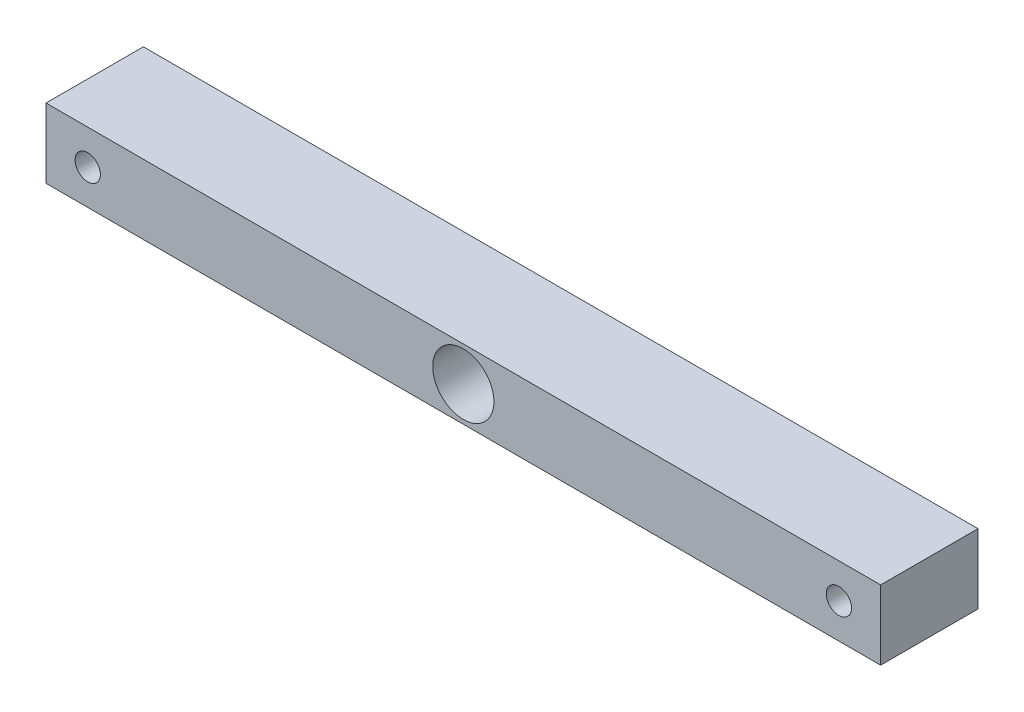
ISO-10303-21;
HEADER;
FILE_DESCRIPTION(('STEP AP214'),'2;1');
FILE_NAME('part.step','',(''),(''),'','','');
FILE_SCHEMA(('AUTOMOTIVE_DESIGN { 1 0 10303 214 1 1 1 1 }'));
ENDSEC;
DATA;
#1=APPLICATION_CONTEXT('core data for automotive mechanical design processes');
#2=APPLICATION_PROTOCOL_DEFINITION('international standard','automotive_design',2000,#1);
#3=PRODUCT_CONTEXT('',#1,'mechanical');
#4=PRODUCT('Part','Part','',(#3));
#5=PRODUCT_RELATED_PRODUCT_CATEGORY('part','',(#4));
#6=PRODUCT_DEFINITION_FORMATION('','',#4);
#7=PRODUCT_DEFINITION_CONTEXT('part definition',#1,'design');
#8=PRODUCT_DEFINITION('design','',#6,#7);
#9=PRODUCT_DEFINITION_SHAPE('','',#8);
#10=(LENGTH_UNIT() NAMED_UNIT(*) SI_UNIT(.MILLI.,.METRE.));
#11=(NAMED_UNIT(*) PLANE_ANGLE_UNIT() SI_UNIT($,.RADIAN.));
#12=(NAMED_UNIT(*) SI_UNIT($,.STERADIAN.) SOLID_ANGLE_UNIT());
#13=UNCERTAINTY_MEASURE_WITH_UNIT(LENGTH_MEASURE(1.E-05),#10,'distance_accuracy_value','');
#14=(GEOMETRIC_REPRESENTATION_CONTEXT(3) GLOBAL_UNCERTAINTY_ASSIGNED_CONTEXT((#13)) GLOBAL_UNIT_ASSIGNED_CONTEXT((#10,
#11,#12)) REPRESENTATION_CONTEXT('',''));
#15=CARTESIAN_POINT('',(0.,0.,0.));
#16=DIRECTION('',(0.,0.,1.));
#17=DIRECTION('',(1.,0.,0.));
#18=AXIS2_PLACEMENT_3D('',#15,#16,#17);
#19=CARTESIAN_POINT('',(150.,-12.5,35.));
#20=DIRECTION('',(-1.,0.,0.));
#21=DIRECTION('',(0.,0.,1.));
#22=AXIS2_PLACEMENT_3D('',#19,#20,#21);
#23=PLANE('',#22);
#24=DIRECTION('',(0.,1.,0.));
#25=VECTOR('',#24,1.);
#26=CARTESIAN_POINT('',(150.,-12.5,0.));
#27=LINE('',#26,#25);
#28=CARTESIAN_POINT('',(150.,-12.5,0.));
#29=VERTEX_POINT('',#28);
#30=CARTESIAN_POINT('',(150.,12.5,0.));
#31=VERTEX_POINT('',#30);
#32=EDGE_CURVE('E96',#29,#31,#27,.T.);
#33=ORIENTED_EDGE('',*,*,#32,.T.);
#34=DIRECTION('',(0.,0.,-1.));
#35=VECTOR('',#34,1.);
#36=CARTESIAN_POINT('',(150.,12.5,35.));
#37=LINE('',#36,#35);
#38=CARTESIAN_POINT('',(150.,12.5,35.));
#39=VERTEX_POINT('',#38);
#40=EDGE_CURVE('E11',#39,#31,#37,.T.);
#41=ORIENTED_EDGE('',*,*,#40,.F.);
#42=DIRECTION('',(0.,1.,0.));
#43=VECTOR('',#42,1.);
#44=CARTESIAN_POINT('',(150.,-12.5,35.));
#45=LINE('',#44,#43);
#46=CARTESIAN_POINT('',(150.,-12.5,35.));
#47=VERTEX_POINT('',#46);
#48=EDGE_CURVE('E84',#47,#39,#45,.T.);
#49=ORIENTED_EDGE('',*,*,#48,.F.);
#50=DIRECTION('',(0.,0.,-1.));
#51=VECTOR('',#50,1.);
#52=CARTESIAN_POINT('',(150.,-12.5,35.));
#53=LINE('',#52,#51);
#54=EDGE_CURVE('E92',#47,#29,#53,.T.);
#55=ORIENTED_EDGE('',*,*,#54,.T.);
#56=EDGE_LOOP('',(#33,#41,#49,#55));
#57=FACE_BOUND('',#56,.T.);
#58=ADVANCED_FACE('F33',(#57),#23,.F.);
#59=CARTESIAN_POINT('',(-150.,12.5,35.));
#60=DIRECTION('',(0.,-1.,0.));
#61=DIRECTION('',(0.,0.,-1.));
#62=AXIS2_PLACEMENT_3D('',#59,#60,#61);
#63=PLANE('',#62);
#64=DIRECTION('',(-1.,0.,0.));
#65=VECTOR('',#64,1.);
#66=CARTESIAN_POINT('',(-150.,12.5,0.));
#67=LINE('',#66,#65);
#68=CARTESIAN_POINT('',(-150.,12.5,0.));
#69=VERTEX_POINT('',#68);
#70=EDGE_CURVE('E88',#31,#69,#67,.T.);
#71=ORIENTED_EDGE('',*,*,#70,.T.);
#72=DIRECTION('',(0.,0.,-1.));
#73=VECTOR('',#72,1.);
#74=CARTESIAN_POINT('',(-150.,12.5,35.));
#75=LINE('',#74,#73);
#76=CARTESIAN_POINT('',(-150.,12.5,35.));
#77=VERTEX_POINT('',#76);
#78=EDGE_CURVE('E41',#77,#69,#75,.T.);
#79=ORIENTED_EDGE('',*,*,#78,.F.);
#80=DIRECTION('',(-1.,0.,0.));
#81=VECTOR('',#80,1.);
#82=CARTESIAN_POINT('',(-150.,12.5,35.));
#83=LINE('',#82,#81);
#84=EDGE_CURVE('E79',#39,#77,#83,.T.);
#85=ORIENTED_EDGE('',*,*,#84,.F.);
#86=ORIENTED_EDGE('',*,*,#40,.T.);
#87=EDGE_LOOP('',(#71,#79,#85,#86));
#88=FACE_BOUND('',#87,.T.);
#89=ADVANCED_FACE('F87',(#88),#63,.F.);
#90=CARTESIAN_POINT('',(-150.,-12.5,35.));
#91=DIRECTION('',(1.,0.,0.));
#92=DIRECTION('',(0.,0.,-1.));
#93=AXIS2_PLACEMENT_3D('',#90,#91,#92);
#94=PLANE('',#93);
#95=DIRECTION('',(0.,-1.,0.));
#96=VECTOR('',#95,1.);
#97=CARTESIAN_POINT('',(-150.,-12.5,0.));
#98=LINE('',#97,#96);
#99=CARTESIAN_POINT('',(-150.,-12.5,0.));
#100=VERTEX_POINT('',#99);
#101=EDGE_CURVE('E66',#69,#100,#98,.T.);
#102=ORIENTED_EDGE('',*,*,#101,.T.);
#103=DIRECTION('',(0.,0.,-1.));
#104=VECTOR('',#103,1.);
#105=CARTESIAN_POINT('',(-150.,-12.5,35.));
#106=LINE('',#105,#104);
#107=CARTESIAN_POINT('',(-150.,-12.5,35.));
#108=VERTEX_POINT('',#107);
#109=EDGE_CURVE('E89',#108,#100,#106,.T.);
#110=ORIENTED_EDGE('',*,*,#109,.F.);
#111=DIRECTION('',(0.,-1.,0.));
#112=VECTOR('',#111,1.);
#113=CARTESIAN_POINT('',(-150.,-12.5,35.));
#114=LINE('',#113,#112);
#115=EDGE_CURVE('E82',#77,#108,#114,.T.);
#116=ORIENTED_EDGE('',*,*,#115,.F.);
#117=ORIENTED_EDGE('',*,*,#78,.T.);
#118=EDGE_LOOP('',(#102,#110,#116,#117));
#119=FACE_BOUND('',#118,.T.);
#120=ADVANCED_FACE('F90',(#119),#94,.F.);
#121=CARTESIAN_POINT('',(-150.,-12.5,35.));
#122=DIRECTION('',(0.,1.,0.));
#123=DIRECTION('',(0.,0.,1.));
#124=AXIS2_PLACEMENT_3D('',#121,#122,#123);
#125=PLANE('',#124);
#126=DIRECTION('',(1.,0.,0.));
#127=VECTOR('',#126,1.);
#128=CARTESIAN_POINT('',(-150.,-12.5,0.));
#129=LINE('',#128,#127);
#130=EDGE_CURVE('E72',#100,#29,#129,.T.);
#131=ORIENTED_EDGE('',*,*,#130,.T.);
#132=ORIENTED_EDGE('',*,*,#54,.F.);
#133=DIRECTION('',(1.,0.,0.));
#134=VECTOR('',#133,1.);
#135=CARTESIAN_POINT('',(-150.,-12.5,35.));
#136=LINE('',#135,#134);
#137=EDGE_CURVE('E49',#108,#47,#136,.T.);
#138=ORIENTED_EDGE('',*,*,#137,.F.);
#139=ORIENTED_EDGE('',*,*,#109,.T.);
#140=EDGE_LOOP('',(#131,#132,#138,#139));
#141=FACE_BOUND('',#140,.T.);
#142=ADVANCED_FACE('F104',(#141),#125,.F.);
#143=CARTESIAN_POINT('',(0.,0.,35.));
#144=DIRECTION('',(0.,0.,-1.));
#145=DIRECTION('',(-1.,0.,0.));
#146=AXIS2_PLACEMENT_3D('',#143,#144,#145);
#147=PLANE('',#146);
#148=CARTESIAN_POINT('',(-135.,0.,35.));
#149=DIRECTION('',(0.,0.,1.));
#150=DIRECTION('',(1.,0.,0.));
#151=AXIS2_PLACEMENT_3D('',#148,#149,#150);
#152=CIRCLE('',#151,4.54239158828718);
#153=CARTESIAN_POINT('',(-130.457608411713,0.,35.));
#154=VERTEX_POINT('',#153);
#155=EDGE_CURVE('E122',#154,#154,#152,.T.);
#156=ORIENTED_EDGE('',*,*,#155,.F.);
#157=EDGE_LOOP('',(#156));
#158=FACE_BOUND('',#157,.T.);
#159=CARTESIAN_POINT('',(0.,0.,35.));
#160=DIRECTION('',(0.,0.,1.));
#161=DIRECTION('',(1.,0.,0.));
#162=AXIS2_PLACEMENT_3D('',#159,#160,#161);
#163=CIRCLE('',#162,11.);
#164=CARTESIAN_POINT('',(11.,0.,35.));
#165=VERTEX_POINT('',#164);
#166=EDGE_CURVE('E116',#165,#165,#163,.T.);
#167=ORIENTED_EDGE('',*,*,#166,.F.);
#168=EDGE_LOOP('',(#167));
#169=FACE_BOUND('',#168,.T.);
#170=CARTESIAN_POINT('',(135.,0.,35.));
#171=DIRECTION('',(0.,0.,1.));
#172=DIRECTION('',(1.,0.,0.));
#173=AXIS2_PLACEMENT_3D('',#170,#171,#172);
#174=CIRCLE('',#173,4.54239158828718);
#175=CARTESIAN_POINT('',(139.542391588287,0.,35.));
#176=VERTEX_POINT('',#175);
#177=EDGE_CURVE('E110',#176,#176,#174,.T.);
#178=ORIENTED_EDGE('',*,*,#177,.F.);
#179=EDGE_LOOP('',(#178));
#180=FACE_BOUND('',#179,.T.);
#181=ORIENTED_EDGE('',*,*,#48,.T.);
#182=ORIENTED_EDGE('',*,*,#84,.T.);
#183=ORIENTED_EDGE('',*,*,#115,.T.);
#184=ORIENTED_EDGE('',*,*,#137,.T.);
#185=EDGE_LOOP('',(#181,#182,#183,#184));
#186=FACE_BOUND('',#185,.T.);
#187=ADVANCED_FACE('F80',(#158,#169,#180,#186),#147,.F.);
#188=CARTESIAN_POINT('',(0.,0.,0.));
#189=DIRECTION('',(0.,0.,-1.));
#190=DIRECTION('',(-1.,0.,0.));
#191=AXIS2_PLACEMENT_3D('',#188,#189,#190);
#192=PLANE('',#191);
#193=CARTESIAN_POINT('',(-135.,0.,0.));
#194=DIRECTION('',(0.,0.,1.));
#195=DIRECTION('',(1.,0.,0.));
#196=AXIS2_PLACEMENT_3D('',#193,#194,#195);
#197=CIRCLE('',#196,4.54239158828718);
#198=CARTESIAN_POINT('',(-130.457608411713,0.,0.));
#199=VERTEX_POINT('',#198);
#200=EDGE_CURVE('E99',#199,#199,#197,.T.);
#201=ORIENTED_EDGE('',*,*,#200,.T.);
#202=EDGE_LOOP('',(#201));
#203=FACE_BOUND('',#202,.T.);
#204=CARTESIAN_POINT('',(0.,0.,0.));
#205=DIRECTION('',(0.,0.,1.));
#206=DIRECTION('',(1.,0.,0.));
#207=AXIS2_PLACEMENT_3D('',#204,#205,#206);
#208=CIRCLE('',#207,11.);
#209=CARTESIAN_POINT('',(11.,0.,0.));
#210=VERTEX_POINT('',#209);
#211=EDGE_CURVE('E119',#210,#210,#208,.T.);
#212=ORIENTED_EDGE('',*,*,#211,.T.);
#213=EDGE_LOOP('',(#212));
#214=FACE_BOUND('',#213,.T.);
#215=CARTESIAN_POINT('',(135.,0.,0.));
#216=DIRECTION('',(0.,0.,1.));
#217=DIRECTION('',(1.,0.,0.));
#218=AXIS2_PLACEMENT_3D('',#215,#216,#217);
#219=CIRCLE('',#218,4.54239158828718);
#220=CARTESIAN_POINT('',(139.542391588287,0.,0.));
#221=VERTEX_POINT('',#220);
#222=EDGE_CURVE('E113',#221,#221,#219,.T.);
#223=ORIENTED_EDGE('',*,*,#222,.T.);
#224=EDGE_LOOP('',(#223));
#225=FACE_BOUND('',#224,.T.);
#226=ORIENTED_EDGE('',*,*,#32,.F.);
#227=ORIENTED_EDGE('',*,*,#130,.F.);
#228=ORIENTED_EDGE('',*,*,#101,.F.);
#229=ORIENTED_EDGE('',*,*,#70,.F.);
#230=EDGE_LOOP('',(#226,#227,#228,#229));
#231=FACE_BOUND('',#230,.T.);
#232=ADVANCED_FACE('F107',(#203,#214,#225,#231),#192,.T.);
#233=CARTESIAN_POINT('',(135.,0.,0.));
#234=DIRECTION('',(0.,0.,1.));
#235=DIRECTION('',(1.,0.,0.));
#236=AXIS2_PLACEMENT_3D('',#233,#234,#235);
#237=CYLINDRICAL_SURFACE('',#236,4.54239158828718);
#238=ORIENTED_EDGE('',*,*,#222,.F.);
#239=EDGE_LOOP('',(#238));
#240=FACE_BOUND('',#239,.T.);
#241=ORIENTED_EDGE('',*,*,#177,.T.);
#242=EDGE_LOOP('',(#241));
#243=FACE_BOUND('',#242,.T.);
#244=ADVANCED_FACE('F144',(#240,#243),#237,.F.);
#245=CARTESIAN_POINT('',(0.,0.,0.));
#246=DIRECTION('',(0.,0.,1.));
#247=DIRECTION('',(1.,0.,0.));
#248=AXIS2_PLACEMENT_3D('',#245,#246,#247);
#249=CYLINDRICAL_SURFACE('',#248,11.);
#250=ORIENTED_EDGE('',*,*,#211,.F.);
#251=EDGE_LOOP('',(#250));
#252=FACE_BOUND('',#251,.T.);
#253=ORIENTED_EDGE('',*,*,#166,.T.);
#254=EDGE_LOOP('',(#253));
#255=FACE_BOUND('',#254,.T.);
#256=ADVANCED_FACE('F133',(#252,#255),#249,.F.);
#257=CARTESIAN_POINT('',(-135.,0.,0.));
#258=DIRECTION('',(0.,0.,1.));
#259=DIRECTION('',(1.,0.,0.));
#260=AXIS2_PLACEMENT_3D('',#257,#258,#259);
#261=CYLINDRICAL_SURFACE('',#260,4.54239158828718);
#262=ORIENTED_EDGE('',*,*,#200,.F.);
#263=EDGE_LOOP('',(#262));
#264=FACE_BOUND('',#263,.T.);
#265=ORIENTED_EDGE('',*,*,#155,.T.);
#266=EDGE_LOOP('',(#265));
#267=FACE_BOUND('',#266,.T.);
#268=ADVANCED_FACE('F130',(#264,#267),#261,.F.);
#269=CLOSED_SHELL('',(#58,#89,#120,#142,#187,#232,#244,#256,#268));
#270=MANIFOLD_SOLID_BREP('B2',#269);
#271=ADVANCED_BREP_SHAPE_REPRESENTATION('',(#18,#270),#14);
#272=SHAPE_DEFINITION_REPRESENTATION(#9,#271);
ENDSEC;
END-ISO-10303-21;
